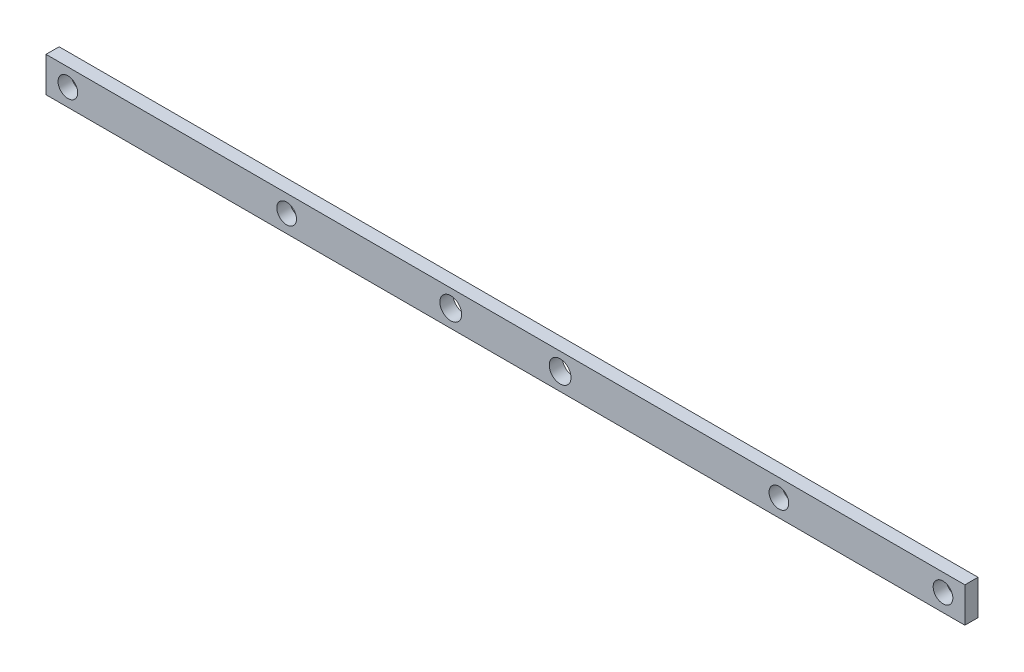
ISO-10303-21;
HEADER;
FILE_DESCRIPTION(('STEP AP214'),'2;1');
FILE_NAME('part.step','',(''),(''),'','','');
FILE_SCHEMA(('AUTOMOTIVE_DESIGN { 1 0 10303 214 1 1 1 1 }'));
ENDSEC;
DATA;
#1=APPLICATION_CONTEXT('core data for automotive mechanical design processes');
#2=APPLICATION_PROTOCOL_DEFINITION('international standard','automotive_design',2000,#1);
#3=PRODUCT_CONTEXT('',#1,'mechanical');
#4=PRODUCT('Part','Part','',(#3));
#5=PRODUCT_RELATED_PRODUCT_CATEGORY('part','',(#4));
#6=PRODUCT_DEFINITION_FORMATION('','',#4);
#7=PRODUCT_DEFINITION_CONTEXT('part definition',#1,'design');
#8=PRODUCT_DEFINITION('design','',#6,#7);
#9=PRODUCT_DEFINITION_SHAPE('','',#8);
#10=(LENGTH_UNIT() NAMED_UNIT(*) SI_UNIT(.MILLI.,.METRE.));
#11=(NAMED_UNIT(*) PLANE_ANGLE_UNIT() SI_UNIT($,.RADIAN.));
#12=(NAMED_UNIT(*) SI_UNIT($,.STERADIAN.) SOLID_ANGLE_UNIT());
#13=UNCERTAINTY_MEASURE_WITH_UNIT(LENGTH_MEASURE(1.E-05),#10,'distance_accuracy_value','');
#14=(GEOMETRIC_REPRESENTATION_CONTEXT(3) GLOBAL_UNCERTAINTY_ASSIGNED_CONTEXT((#13)) GLOBAL_UNIT_ASSIGNED_CONTEXT((#10,
#11,#12)) REPRESENTATION_CONTEXT('',''));
#15=CARTESIAN_POINT('',(0.,0.,0.));
#16=DIRECTION('',(0.,0.,1.));
#17=DIRECTION('',(1.,0.,0.));
#18=AXIS2_PLACEMENT_3D('',#15,#16,#17);
#19=CARTESIAN_POINT('',(0.,0.,3.));
#20=DIRECTION('',(0.,0.,-1.));
#21=DIRECTION('',(-1.,0.,0.));
#22=AXIS2_PLACEMENT_3D('',#19,#20,#21);
#23=PLANE('',#22);
#24=DIRECTION('',(0.,1.,0.));
#25=VECTOR('',#24,1.);
#26=CARTESIAN_POINT('',(105.,-4.,3.));
#27=LINE('',#26,#25);
#28=CARTESIAN_POINT('',(105.,-4.,3.));
#29=VERTEX_POINT('',#28);
#30=CARTESIAN_POINT('',(105.,4.,3.));
#31=VERTEX_POINT('',#30);
#32=EDGE_CURVE('E103',#29,#31,#27,.T.);
#33=ORIENTED_EDGE('',*,*,#32,.T.);
#34=DIRECTION('',(-1.,0.,0.));
#35=VECTOR('',#34,1.);
#36=CARTESIAN_POINT('',(-105.,4.,3.));
#37=LINE('',#36,#35);
#38=CARTESIAN_POINT('',(-105.,4.,3.));
#39=VERTEX_POINT('',#38);
#40=EDGE_CURVE('E98',#31,#39,#37,.T.);
#41=ORIENTED_EDGE('',*,*,#40,.T.);
#42=DIRECTION('',(0.,-1.,0.));
#43=VECTOR('',#42,1.);
#44=CARTESIAN_POINT('',(-105.,-4.,3.));
#45=LINE('',#44,#43);
#46=CARTESIAN_POINT('',(-105.,-4.,3.));
#47=VERTEX_POINT('',#46);
#48=EDGE_CURVE('E101',#39,#47,#45,.T.);
#49=ORIENTED_EDGE('',*,*,#48,.T.);
#50=DIRECTION('',(1.,0.,0.));
#51=VECTOR('',#50,1.);
#52=CARTESIAN_POINT('',(-105.,-4.,3.));
#53=LINE('',#52,#51);
#54=EDGE_CURVE('E68',#47,#29,#53,.T.);
#55=ORIENTED_EDGE('',*,*,#54,.T.);
#56=EDGE_LOOP('',(#33,#41,#49,#55));
#57=FACE_BOUND('',#56,.T.);
#58=CARTESIAN_POINT('',(-12.5,0.,3.));
#59=DIRECTION('',(0.,0.,1.));
#60=DIRECTION('',(1.,0.,0.));
#61=AXIS2_PLACEMENT_3D('',#58,#59,#60);
#62=CIRCLE('',#61,2.49);
#63=CARTESIAN_POINT('',(-10.01,0.,3.));
#64=VERTEX_POINT('',#63);
#65=EDGE_CURVE('E118',#64,#64,#62,.T.);
#66=ORIENTED_EDGE('',*,*,#65,.F.);
#67=EDGE_LOOP('',(#66));
#68=FACE_BOUND('',#67,.T.);
#69=CARTESIAN_POINT('',(12.5,0.,3.));
#70=DIRECTION('',(0.,0.,1.));
#71=DIRECTION('',(1.,0.,0.));
#72=AXIS2_PLACEMENT_3D('',#69,#70,#71);
#73=CIRCLE('',#72,2.49);
#74=CARTESIAN_POINT('',(14.99,0.,3.));
#75=VERTEX_POINT('',#74);
#76=EDGE_CURVE('E133',#75,#75,#73,.T.);
#77=ORIENTED_EDGE('',*,*,#76,.F.);
#78=EDGE_LOOP('',(#77));
#79=FACE_BOUND('',#78,.T.);
#80=CARTESIAN_POINT('',(100.,0.,3.));
#81=DIRECTION('',(0.,0.,1.));
#82=DIRECTION('',(1.,0.,0.));
#83=AXIS2_PLACEMENT_3D('',#80,#81,#82);
#84=CIRCLE('',#83,2.25);
#85=CARTESIAN_POINT('',(102.25,0.,3.));
#86=VERTEX_POINT('',#85);
#87=EDGE_CURVE('E139',#86,#86,#84,.T.);
#88=ORIENTED_EDGE('',*,*,#87,.F.);
#89=EDGE_LOOP('',(#88));
#90=FACE_BOUND('',#89,.T.);
#91=CARTESIAN_POINT('',(-100.,0.,3.));
#92=DIRECTION('',(0.,0.,1.));
#93=DIRECTION('',(1.,0.,0.));
#94=AXIS2_PLACEMENT_3D('',#91,#92,#93);
#95=CIRCLE('',#94,2.25);
#96=CARTESIAN_POINT('',(-97.75,0.,3.));
#97=VERTEX_POINT('',#96);
#98=EDGE_CURVE('E145',#97,#97,#95,.T.);
#99=ORIENTED_EDGE('',*,*,#98,.F.);
#100=EDGE_LOOP('',(#99));
#101=FACE_BOUND('',#100,.T.);
#102=CARTESIAN_POINT('',(-50.,0.,3.));
#103=DIRECTION('',(0.,0.,1.));
#104=DIRECTION('',(1.,0.,0.));
#105=AXIS2_PLACEMENT_3D('',#102,#103,#104);
#106=CIRCLE('',#105,2.25);
#107=CARTESIAN_POINT('',(-47.75,0.,3.));
#108=VERTEX_POINT('',#107);
#109=EDGE_CURVE('E151',#108,#108,#106,.T.);
#110=ORIENTED_EDGE('',*,*,#109,.F.);
#111=EDGE_LOOP('',(#110));
#112=FACE_BOUND('',#111,.T.);
#113=CARTESIAN_POINT('',(62.5,0.,3.));
#114=DIRECTION('',(0.,0.,1.));
#115=DIRECTION('',(1.,0.,0.));
#116=AXIS2_PLACEMENT_3D('',#113,#114,#115);
#117=CIRCLE('',#116,2.25);
#118=CARTESIAN_POINT('',(64.75,0.,3.));
#119=VERTEX_POINT('',#118);
#120=EDGE_CURVE('E157',#119,#119,#117,.T.);
#121=ORIENTED_EDGE('',*,*,#120,.F.);
#122=EDGE_LOOP('',(#121));
#123=FACE_BOUND('',#122,.T.);
#124=ADVANCED_FACE('F51',(#57,#68,#79,#90,#101,#112,#123),#23,.F.);
#125=CARTESIAN_POINT('',(0.,0.,0.));
#126=DIRECTION('',(0.,0.,-1.));
#127=DIRECTION('',(-1.,0.,0.));
#128=AXIS2_PLACEMENT_3D('',#125,#126,#127);
#129=PLANE('',#128);
#130=CARTESIAN_POINT('',(-50.,0.,0.));
#131=DIRECTION('',(0.,0.,1.));
#132=DIRECTION('',(1.,0.,0.));
#133=AXIS2_PLACEMENT_3D('',#130,#131,#132);
#134=CIRCLE('',#133,2.25);
#135=CARTESIAN_POINT('',(-47.75,0.,0.));
#136=VERTEX_POINT('',#135);
#137=EDGE_CURVE('E154',#136,#136,#134,.T.);
#138=ORIENTED_EDGE('',*,*,#137,.T.);
#139=EDGE_LOOP('',(#138));
#140=FACE_BOUND('',#139,.T.);
#141=CARTESIAN_POINT('',(100.,0.,0.));
#142=DIRECTION('',(0.,0.,1.));
#143=DIRECTION('',(1.,0.,0.));
#144=AXIS2_PLACEMENT_3D('',#141,#142,#143);
#145=CIRCLE('',#144,2.25);
#146=CARTESIAN_POINT('',(102.25,0.,0.));
#147=VERTEX_POINT('',#146);
#148=EDGE_CURVE('E142',#147,#147,#145,.T.);
#149=ORIENTED_EDGE('',*,*,#148,.T.);
#150=EDGE_LOOP('',(#149));
#151=FACE_BOUND('',#150,.T.);
#152=CARTESIAN_POINT('',(-12.5,0.,0.));
#153=DIRECTION('',(0.,0.,1.));
#154=DIRECTION('',(1.,0.,0.));
#155=AXIS2_PLACEMENT_3D('',#152,#153,#154);
#156=CIRCLE('',#155,2.49);
#157=CARTESIAN_POINT('',(-10.01,0.,0.));
#158=VERTEX_POINT('',#157);
#159=EDGE_CURVE('E130',#158,#158,#156,.T.);
#160=ORIENTED_EDGE('',*,*,#159,.T.);
#161=EDGE_LOOP('',(#160));
#162=FACE_BOUND('',#161,.T.);
#163=DIRECTION('',(0.,1.,0.));
#164=VECTOR('',#163,1.);
#165=CARTESIAN_POINT('',(105.,-4.,0.));
#166=LINE('',#165,#164);
#167=CARTESIAN_POINT('',(105.,-4.,0.));
#168=VERTEX_POINT('',#167);
#169=CARTESIAN_POINT('',(105.,4.,0.));
#170=VERTEX_POINT('',#169);
#171=EDGE_CURVE('E115',#168,#170,#166,.T.);
#172=ORIENTED_EDGE('',*,*,#171,.F.);
#173=DIRECTION('',(1.,0.,0.));
#174=VECTOR('',#173,1.);
#175=CARTESIAN_POINT('',(-105.,-4.,0.));
#176=LINE('',#175,#174);
#177=CARTESIAN_POINT('',(-105.,-4.,0.));
#178=VERTEX_POINT('',#177);
#179=EDGE_CURVE('E91',#178,#168,#176,.T.);
#180=ORIENTED_EDGE('',*,*,#179,.F.);
#181=DIRECTION('',(0.,-1.,0.));
#182=VECTOR('',#181,1.);
#183=CARTESIAN_POINT('',(-105.,-4.,0.));
#184=LINE('',#183,#182);
#185=CARTESIAN_POINT('',(-105.,4.,0.));
#186=VERTEX_POINT('',#185);
#187=EDGE_CURVE('E85',#186,#178,#184,.T.);
#188=ORIENTED_EDGE('',*,*,#187,.F.);
#189=DIRECTION('',(-1.,0.,0.));
#190=VECTOR('',#189,1.);
#191=CARTESIAN_POINT('',(-105.,4.,0.));
#192=LINE('',#191,#190);
#193=EDGE_CURVE('E107',#170,#186,#192,.T.);
#194=ORIENTED_EDGE('',*,*,#193,.F.);
#195=EDGE_LOOP('',(#172,#180,#188,#194));
#196=FACE_BOUND('',#195,.T.);
#197=CARTESIAN_POINT('',(12.5,0.,0.));
#198=DIRECTION('',(0.,0.,1.));
#199=DIRECTION('',(1.,0.,0.));
#200=AXIS2_PLACEMENT_3D('',#197,#198,#199);
#201=CIRCLE('',#200,2.49);
#202=CARTESIAN_POINT('',(14.99,0.,0.));
#203=VERTEX_POINT('',#202);
#204=EDGE_CURVE('E136',#203,#203,#201,.T.);
#205=ORIENTED_EDGE('',*,*,#204,.T.);
#206=EDGE_LOOP('',(#205));
#207=FACE_BOUND('',#206,.T.);
#208=CARTESIAN_POINT('',(-100.,0.,0.));
#209=DIRECTION('',(0.,0.,1.));
#210=DIRECTION('',(1.,0.,0.));
#211=AXIS2_PLACEMENT_3D('',#208,#209,#210);
#212=CIRCLE('',#211,2.25);
#213=CARTESIAN_POINT('',(-97.75,0.,0.));
#214=VERTEX_POINT('',#213);
#215=EDGE_CURVE('E148',#214,#214,#212,.T.);
#216=ORIENTED_EDGE('',*,*,#215,.T.);
#217=EDGE_LOOP('',(#216));
#218=FACE_BOUND('',#217,.T.);
#219=CARTESIAN_POINT('',(62.5,0.,0.));
#220=DIRECTION('',(0.,0.,1.));
#221=DIRECTION('',(1.,0.,0.));
#222=AXIS2_PLACEMENT_3D('',#219,#220,#221);
#223=CIRCLE('',#222,2.25);
#224=CARTESIAN_POINT('',(64.75,0.,0.));
#225=VERTEX_POINT('',#224);
#226=EDGE_CURVE('E160',#225,#225,#223,.T.);
#227=ORIENTED_EDGE('',*,*,#226,.T.);
#228=EDGE_LOOP('',(#227));
#229=FACE_BOUND('',#228,.T.);
#230=ADVANCED_FACE('F126',(#140,#151,#162,#196,#207,#218,#229),#129,.T.);
#231=CARTESIAN_POINT('',(105.,-4.,3.));
#232=DIRECTION('',(-1.,0.,0.));
#233=DIRECTION('',(0.,0.,1.));
#234=AXIS2_PLACEMENT_3D('',#231,#232,#233);
#235=PLANE('',#234);
#236=ORIENTED_EDGE('',*,*,#171,.T.);
#237=DIRECTION('',(0.,0.,-1.));
#238=VECTOR('',#237,1.);
#239=CARTESIAN_POINT('',(105.,4.,3.));
#240=LINE('',#239,#238);
#241=EDGE_CURVE('E13',#31,#170,#240,.T.);
#242=ORIENTED_EDGE('',*,*,#241,.F.);
#243=ORIENTED_EDGE('',*,*,#32,.F.);
#244=DIRECTION('',(0.,0.,-1.));
#245=VECTOR('',#244,1.);
#246=CARTESIAN_POINT('',(105.,-4.,3.));
#247=LINE('',#246,#245);
#248=EDGE_CURVE('E111',#29,#168,#247,.T.);
#249=ORIENTED_EDGE('',*,*,#248,.T.);
#250=EDGE_LOOP('',(#236,#242,#243,#249));
#251=FACE_BOUND('',#250,.T.);
#252=ADVANCED_FACE('F53',(#251),#235,.F.);
#253=CARTESIAN_POINT('',(-105.,4.,3.));
#254=DIRECTION('',(0.,-1.,0.));
#255=DIRECTION('',(0.,0.,-1.));
#256=AXIS2_PLACEMENT_3D('',#253,#254,#255);
#257=PLANE('',#256);
#258=ORIENTED_EDGE('',*,*,#193,.T.);
#259=DIRECTION('',(0.,0.,-1.));
#260=VECTOR('',#259,1.);
#261=CARTESIAN_POINT('',(-105.,4.,3.));
#262=LINE('',#261,#260);
#263=EDGE_CURVE('E60',#39,#186,#262,.T.);
#264=ORIENTED_EDGE('',*,*,#263,.F.);
#265=ORIENTED_EDGE('',*,*,#40,.F.);
#266=ORIENTED_EDGE('',*,*,#241,.T.);
#267=EDGE_LOOP('',(#258,#264,#265,#266));
#268=FACE_BOUND('',#267,.T.);
#269=ADVANCED_FACE('F106',(#268),#257,.F.);
#270=CARTESIAN_POINT('',(-105.,-4.,3.));
#271=DIRECTION('',(1.,0.,0.));
#272=DIRECTION('',(0.,0.,-1.));
#273=AXIS2_PLACEMENT_3D('',#270,#271,#272);
#274=PLANE('',#273);
#275=ORIENTED_EDGE('',*,*,#187,.T.);
#276=DIRECTION('',(0.,0.,-1.));
#277=VECTOR('',#276,1.);
#278=CARTESIAN_POINT('',(-105.,-4.,3.));
#279=LINE('',#278,#277);
#280=EDGE_CURVE('E108',#47,#178,#279,.T.);
#281=ORIENTED_EDGE('',*,*,#280,.F.);
#282=ORIENTED_EDGE('',*,*,#48,.F.);
#283=ORIENTED_EDGE('',*,*,#263,.T.);
#284=EDGE_LOOP('',(#275,#281,#282,#283));
#285=FACE_BOUND('',#284,.T.);
#286=ADVANCED_FACE('F109',(#285),#274,.F.);
#287=CARTESIAN_POINT('',(-105.,-4.,3.));
#288=DIRECTION('',(0.,1.,0.));
#289=DIRECTION('',(-1.,0.,0.));
#290=AXIS2_PLACEMENT_3D('',#287,#288,#289);
#291=PLANE('',#290);
#292=ORIENTED_EDGE('',*,*,#179,.T.);
#293=ORIENTED_EDGE('',*,*,#248,.F.);
#294=ORIENTED_EDGE('',*,*,#54,.F.);
#295=ORIENTED_EDGE('',*,*,#280,.T.);
#296=EDGE_LOOP('',(#292,#293,#294,#295));
#297=FACE_BOUND('',#296,.T.);
#298=ADVANCED_FACE('F123',(#297),#291,.F.);
#299=CARTESIAN_POINT('',(-12.5,0.,3.));
#300=DIRECTION('',(0.,0.,-1.));
#301=DIRECTION('',(-1.,0.,0.));
#302=AXIS2_PLACEMENT_3D('',#299,#300,#301);
#303=CYLINDRICAL_SURFACE('',#302,2.49);
#304=ORIENTED_EDGE('',*,*,#65,.T.);
#305=EDGE_LOOP('',(#304));
#306=FACE_BOUND('',#305,.T.);
#307=ORIENTED_EDGE('',*,*,#159,.F.);
#308=EDGE_LOOP('',(#307));
#309=FACE_BOUND('',#308,.T.);
#310=ADVANCED_FACE('F177',(#306,#309),#303,.F.);
#311=CARTESIAN_POINT('',(12.5,0.,3.));
#312=DIRECTION('',(0.,0.,-1.));
#313=DIRECTION('',(-1.,0.,0.));
#314=AXIS2_PLACEMENT_3D('',#311,#312,#313);
#315=CYLINDRICAL_SURFACE('',#314,2.49);
#316=ORIENTED_EDGE('',*,*,#76,.T.);
#317=EDGE_LOOP('',(#316));
#318=FACE_BOUND('',#317,.T.);
#319=ORIENTED_EDGE('',*,*,#204,.F.);
#320=EDGE_LOOP('',(#319));
#321=FACE_BOUND('',#320,.T.);
#322=ADVANCED_FACE('F222',(#318,#321),#315,.F.);
#323=CARTESIAN_POINT('',(100.,0.,3.));
#324=DIRECTION('',(0.,0.,-1.));
#325=DIRECTION('',(-1.,0.,0.));
#326=AXIS2_PLACEMENT_3D('',#323,#324,#325);
#327=CYLINDRICAL_SURFACE('',#326,2.25);
#328=ORIENTED_EDGE('',*,*,#87,.T.);
#329=EDGE_LOOP('',(#328));
#330=FACE_BOUND('',#329,.T.);
#331=ORIENTED_EDGE('',*,*,#148,.F.);
#332=EDGE_LOOP('',(#331));
#333=FACE_BOUND('',#332,.T.);
#334=ADVANCED_FACE('F230',(#330,#333),#327,.F.);
#335=CARTESIAN_POINT('',(-100.,0.,3.));
#336=DIRECTION('',(0.,0.,-1.));
#337=DIRECTION('',(-1.,0.,0.));
#338=AXIS2_PLACEMENT_3D('',#335,#336,#337);
#339=CYLINDRICAL_SURFACE('',#338,2.25);
#340=ORIENTED_EDGE('',*,*,#98,.T.);
#341=EDGE_LOOP('',(#340));
#342=FACE_BOUND('',#341,.T.);
#343=ORIENTED_EDGE('',*,*,#215,.F.);
#344=EDGE_LOOP('',(#343));
#345=FACE_BOUND('',#344,.T.);
#346=ADVANCED_FACE('F238',(#342,#345),#339,.F.);
#347=CARTESIAN_POINT('',(-50.,0.,3.));
#348=DIRECTION('',(0.,0.,-1.));
#349=DIRECTION('',(-1.,0.,0.));
#350=AXIS2_PLACEMENT_3D('',#347,#348,#349);
#351=CYLINDRICAL_SURFACE('',#350,2.25);
#352=ORIENTED_EDGE('',*,*,#109,.T.);
#353=EDGE_LOOP('',(#352));
#354=FACE_BOUND('',#353,.T.);
#355=ORIENTED_EDGE('',*,*,#137,.F.);
#356=EDGE_LOOP('',(#355));
#357=FACE_BOUND('',#356,.T.);
#358=ADVANCED_FACE('F247',(#354,#357),#351,.F.);
#359=CARTESIAN_POINT('',(62.5,0.,3.));
#360=DIRECTION('',(0.,0.,-1.));
#361=DIRECTION('',(-1.,0.,0.));
#362=AXIS2_PLACEMENT_3D('',#359,#360,#361);
#363=CYLINDRICAL_SURFACE('',#362,2.25);
#364=ORIENTED_EDGE('',*,*,#120,.T.);
#365=EDGE_LOOP('',(#364));
#366=FACE_BOUND('',#365,.T.);
#367=ORIENTED_EDGE('',*,*,#226,.F.);
#368=EDGE_LOOP('',(#367));
#369=FACE_BOUND('',#368,.T.);
#370=ADVANCED_FACE('F166',(#366,#369),#363,.F.);
#371=CLOSED_SHELL('',(#124,#230,#252,#269,#286,#298,#310,#322,#334,#346,#358,#370));
#372=MANIFOLD_SOLID_BREP('B2',#371);
#373=ADVANCED_BREP_SHAPE_REPRESENTATION('',(#18,#372),#14);
#374=SHAPE_DEFINITION_REPRESENTATION(#9,#373);
ENDSEC;
END-ISO-10303-21;
